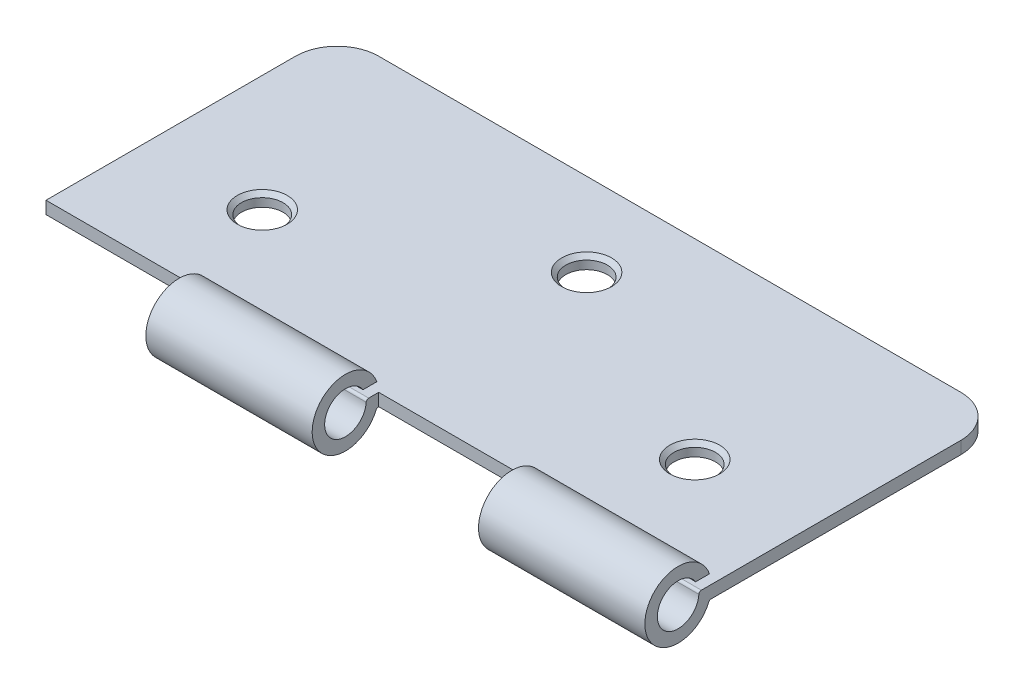
ISO-10303-21;
HEADER;
FILE_DESCRIPTION(('STEP AP214'),'2;1');
FILE_NAME('part.step','',(''),(''),'','','');
FILE_SCHEMA(('AUTOMOTIVE_DESIGN { 1 0 10303 214 1 1 1 1 }'));
ENDSEC;
DATA;
#1=APPLICATION_CONTEXT('core data for automotive mechanical design processes');
#2=APPLICATION_PROTOCOL_DEFINITION('international standard','automotive_design',2000,#1);
#3=PRODUCT_CONTEXT('',#1,'mechanical');
#4=PRODUCT('Part','Part','',(#3));
#5=PRODUCT_RELATED_PRODUCT_CATEGORY('part','',(#4));
#6=PRODUCT_DEFINITION_FORMATION('','',#4);
#7=PRODUCT_DEFINITION_CONTEXT('part definition',#1,'design');
#8=PRODUCT_DEFINITION('design','',#6,#7);
#9=PRODUCT_DEFINITION_SHAPE('','',#8);
#10=(LENGTH_UNIT() NAMED_UNIT(*) SI_UNIT(.MILLI.,.METRE.));
#11=(NAMED_UNIT(*) PLANE_ANGLE_UNIT() SI_UNIT($,.RADIAN.));
#12=(NAMED_UNIT(*) SI_UNIT($,.STERADIAN.) SOLID_ANGLE_UNIT());
#13=UNCERTAINTY_MEASURE_WITH_UNIT(LENGTH_MEASURE(1.E-05),#10,'distance_accuracy_value','');
#14=(GEOMETRIC_REPRESENTATION_CONTEXT(3) GLOBAL_UNCERTAINTY_ASSIGNED_CONTEXT((#13)) GLOBAL_UNIT_ASSIGNED_CONTEXT((#10,
#11,#12)) REPRESENTATION_CONTEXT('',''));
#15=CARTESIAN_POINT('',(0.,0.,0.));
#16=DIRECTION('',(0.,0.,1.));
#17=DIRECTION('',(1.,0.,0.));
#18=AXIS2_PLACEMENT_3D('',#15,#16,#17);
#19=CARTESIAN_POINT('',(40.,1.5,17.5));
#20=DIRECTION('',(0.,0.,-1.));
#21=DIRECTION('',(-1.,0.,0.));
#22=AXIS2_PLACEMENT_3D('',#19,#20,#21);
#23=PLANE('',#22);
#24=DIRECTION('',(0.,1.,0.));
#25=VECTOR('',#24,1.);
#26=CARTESIAN_POINT('',(-20.,0.,17.5));
#27=LINE('',#26,#25);
#28=CARTESIAN_POINT('',(-20.,0.,17.5));
#29=VERTEX_POINT('',#28);
#30=CARTESIAN_POINT('',(-20.,1.5,17.5));
#31=VERTEX_POINT('',#30);
#32=EDGE_CURVE('E56',#29,#31,#27,.T.);
#33=ORIENTED_EDGE('',*,*,#32,.T.);
#34=DIRECTION('',(1.,0.,0.));
#35=VECTOR('',#34,1.);
#36=CARTESIAN_POINT('',(40.,1.5,17.5));
#37=LINE('',#36,#35);
#38=CARTESIAN_POINT('',(-40.,1.5,17.5));
#39=VERTEX_POINT('',#38);
#40=EDGE_CURVE('E199',#39,#31,#37,.T.);
#41=ORIENTED_EDGE('',*,*,#40,.F.);
#42=DIRECTION('',(0.,-1.,0.));
#43=VECTOR('',#42,1.);
#44=CARTESIAN_POINT('',(-40.,1.5,17.5));
#45=LINE('',#44,#43);
#46=CARTESIAN_POINT('',(-40.,0.,17.5));
#47=VERTEX_POINT('',#46);
#48=EDGE_CURVE('E286',#39,#47,#45,.T.);
#49=ORIENTED_EDGE('',*,*,#48,.T.);
#50=DIRECTION('',(1.,0.,0.));
#51=VECTOR('',#50,1.);
#52=CARTESIAN_POINT('',(40.,0.,17.5));
#53=LINE('',#52,#51);
#54=EDGE_CURVE('E279',#47,#29,#53,.T.);
#55=ORIENTED_EDGE('',*,*,#54,.T.);
#56=EDGE_LOOP('',(#33,#41,#49,#55));
#57=FACE_BOUND('',#56,.T.);
#58=ADVANCED_FACE('F33',(#57),#23,.F.);
#59=CARTESIAN_POINT('',(40.,1.5,17.5));
#60=DIRECTION('',(-1.,0.,0.));
#61=DIRECTION('',(0.,0.,1.));
#62=AXIS2_PLACEMENT_3D('',#59,#60,#61);
#63=PLANE('',#62);
#64=DIRECTION('',(0.,0.,-1.));
#65=VECTOR('',#64,1.);
#66=CARTESIAN_POINT('',(40.,0.,17.5));
#67=LINE('',#66,#65);
#68=CARTESIAN_POINT('',(40.,0.,17.5));
#69=VERTEX_POINT('',#68);
#70=CARTESIAN_POINT('',(40.,0.,-12.5));
#71=VERTEX_POINT('',#70);
#72=EDGE_CURVE('E266',#69,#71,#67,.T.);
#73=ORIENTED_EDGE('',*,*,#72,.T.);
#74=DIRECTION('',(0.,-1.,0.));
#75=VECTOR('',#74,1.);
#76=CARTESIAN_POINT('',(40.,1.5,-12.5));
#77=LINE('',#76,#75);
#78=CARTESIAN_POINT('',(40.,1.5,-12.5));
#79=VERTEX_POINT('',#78);
#80=EDGE_CURVE('E291',#79,#71,#77,.T.);
#81=ORIENTED_EDGE('',*,*,#80,.F.);
#82=DIRECTION('',(0.,0.,-1.));
#83=VECTOR('',#82,1.);
#84=CARTESIAN_POINT('',(40.,1.5,17.5));
#85=LINE('',#84,#83);
#86=CARTESIAN_POINT('',(40.,1.5,18.7035374517229));
#87=VERTEX_POINT('',#86);
#88=EDGE_CURVE('E290',#87,#79,#85,.T.);
#89=ORIENTED_EDGE('',*,*,#88,.F.);
#90=CARTESIAN_POINT('',(40.,1.2,18.7035374517229));
#91=DIRECTION('',(1.,0.,0.));
#92=DIRECTION('',(0.,0.,-1.));
#93=AXIS2_PLACEMENT_3D('',#90,#91,#92);
#94=CIRCLE('',#93,0.299999999999999);
#95=CARTESIAN_POINT('',(40.,1.21876934414288,19.0029497288934));
#96=VERTEX_POINT('',#95);
#97=EDGE_CURVE('E237',#87,#96,#94,.T.);
#98=ORIENTED_EDGE('',*,*,#97,.T.);
#99=CARTESIAN_POINT('',(40.,1.37518054533356,21.4980520386479));
#100=DIRECTION('',(1.,0.,0.));
#101=DIRECTION('',(0.,0.,-1.));
#102=AXIS2_PLACEMENT_3D('',#99,#100,#101);
#103=CIRCLE('',#102,2.5);
#104=CARTESIAN_POINT('',(40.,2.71268890348687,19.3859271863085));
#105=VERTEX_POINT('',#104);
#106=EDGE_CURVE('E526',#105,#96,#103,.T.);
#107=ORIENTED_EDGE('',*,*,#106,.F.);
#108=DIRECTION('',(0.,0.,-1.));
#109=VECTOR('',#108,1.);
#110=CARTESIAN_POINT('',(40.,2.71268890348687,19.3859271863085));
#111=LINE('',#110,#109);
#112=CARTESIAN_POINT('',(40.,2.71268890348687,17.7282945674212));
#113=VERTEX_POINT('',#112);
#114=EDGE_CURVE('E529',#105,#113,#111,.T.);
#115=ORIENTED_EDGE('',*,*,#114,.T.);
#116=CARTESIAN_POINT('',(40.,1.37518054533356,21.4980520386479));
#117=DIRECTION('',(1.,0.,0.));
#118=DIRECTION('',(0.,0.,-1.));
#119=AXIS2_PLACEMENT_3D('',#116,#117,#118);
#120=CIRCLE('',#119,4.);
#121=CARTESIAN_POINT('',(40.,-0.182486040506084,17.8138051946703));
#122=VERTEX_POINT('',#121);
#123=EDGE_CURVE('E375',#113,#122,#120,.T.);
#124=ORIENTED_EDGE('',*,*,#123,.T.);
#125=CARTESIAN_POINT('',(40.,-0.299311034444057,17.537486681372));
#126=DIRECTION('',(1.,0.,0.));
#127=DIRECTION('',(0.,0.,-1.));
#128=AXIS2_PLACEMENT_3D('',#125,#126,#127);
#129=CIRCLE('',#128,0.299999999999998);
#130=CARTESIAN_POINT('',(40.,0.000629130852483725,17.5314952506678));
#131=VERTEX_POINT('',#130);
#132=EDGE_CURVE('E373',#131,#122,#129,.T.);
#133=ORIENTED_EDGE('',*,*,#132,.F.);
#134=DIRECTION('',(0.,0.019971435680647,0.999800550988473));
#135=VECTOR('',#134,1.);
#136=CARTESIAN_POINT('',(40.,0.,17.5));
#137=LINE('',#136,#135);
#138=EDGE_CURVE('E257',#69,#131,#137,.T.);
#139=ORIENTED_EDGE('',*,*,#138,.F.);
#140=EDGE_LOOP('',(#73,#81,#89,#98,#107,#115,#124,#133,#139));
#141=FACE_BOUND('',#140,.T.);
#142=ADVANCED_FACE('F369',(#141),#63,.F.);
#143=CARTESIAN_POINT('',(35.,1.5,-12.5));
#144=DIRECTION('',(0.,-1.,0.));
#145=DIRECTION('',(0.,0.,-1.));
#146=AXIS2_PLACEMENT_3D('',#143,#144,#145);
#147=CYLINDRICAL_SURFACE('',#146,5.);
#148=CARTESIAN_POINT('',(35.,0.,-12.5));
#149=DIRECTION('',(0.,1.,0.));
#150=DIRECTION('',(0.,0.,1.));
#151=AXIS2_PLACEMENT_3D('',#148,#149,#150);
#152=CIRCLE('',#151,5.);
#153=CARTESIAN_POINT('',(35.,0.,-17.5));
#154=VERTEX_POINT('',#153);
#155=EDGE_CURVE('E321',#71,#154,#152,.T.);
#156=ORIENTED_EDGE('',*,*,#155,.T.);
#157=DIRECTION('',(0.,-1.,0.));
#158=VECTOR('',#157,1.);
#159=CARTESIAN_POINT('',(35.,1.5,-17.5));
#160=LINE('',#159,#158);
#161=CARTESIAN_POINT('',(35.,1.5,-17.5));
#162=VERTEX_POINT('',#161);
#163=EDGE_CURVE('E295',#162,#154,#160,.T.);
#164=ORIENTED_EDGE('',*,*,#163,.F.);
#165=CARTESIAN_POINT('',(35.,1.5,-12.5));
#166=DIRECTION('',(0.,1.,0.));
#167=DIRECTION('',(0.,0.,1.));
#168=AXIS2_PLACEMENT_3D('',#165,#166,#167);
#169=CIRCLE('',#168,5.);
#170=EDGE_CURVE('E391',#79,#162,#169,.T.);
#171=ORIENTED_EDGE('',*,*,#170,.F.);
#172=ORIENTED_EDGE('',*,*,#80,.T.);
#173=EDGE_LOOP('',(#156,#164,#171,#172));
#174=FACE_BOUND('',#173,.T.);
#175=ADVANCED_FACE('F406',(#174),#147,.T.);
#176=CARTESIAN_POINT('',(35.,1.5,-17.5));
#177=DIRECTION('',(0.,0.,1.));
#178=DIRECTION('',(1.,0.,0.));
#179=AXIS2_PLACEMENT_3D('',#176,#177,#178);
#180=PLANE('',#179);
#181=DIRECTION('',(-1.,0.,0.));
#182=VECTOR('',#181,1.);
#183=CARTESIAN_POINT('',(35.,0.,-17.5));
#184=LINE('',#183,#182);
#185=CARTESIAN_POINT('',(-35.,0.,-17.5));
#186=VERTEX_POINT('',#185);
#187=EDGE_CURVE('E323',#154,#186,#184,.T.);
#188=ORIENTED_EDGE('',*,*,#187,.T.);
#189=DIRECTION('',(0.,-1.,0.));
#190=VECTOR('',#189,1.);
#191=CARTESIAN_POINT('',(-35.,1.5,-17.5));
#192=LINE('',#191,#190);
#193=CARTESIAN_POINT('',(-35.,1.5,-17.5));
#194=VERTEX_POINT('',#193);
#195=EDGE_CURVE('E298',#194,#186,#192,.T.);
#196=ORIENTED_EDGE('',*,*,#195,.F.);
#197=DIRECTION('',(-1.,0.,0.));
#198=VECTOR('',#197,1.);
#199=CARTESIAN_POINT('',(35.,1.5,-17.5));
#200=LINE('',#199,#198);
#201=EDGE_CURVE('E313',#162,#194,#200,.T.);
#202=ORIENTED_EDGE('',*,*,#201,.F.);
#203=ORIENTED_EDGE('',*,*,#163,.T.);
#204=EDGE_LOOP('',(#188,#196,#202,#203));
#205=FACE_BOUND('',#204,.T.);
#206=ADVANCED_FACE('F397',(#205),#180,.F.);
#207=CARTESIAN_POINT('',(-35.,1.5,-12.5));
#208=DIRECTION('',(0.,-1.,0.));
#209=DIRECTION('',(0.,0.,-1.));
#210=AXIS2_PLACEMENT_3D('',#207,#208,#209);
#211=CYLINDRICAL_SURFACE('',#210,5.);
#212=CARTESIAN_POINT('',(-35.,0.,-12.5));
#213=DIRECTION('',(0.,1.,0.));
#214=DIRECTION('',(0.,0.,1.));
#215=AXIS2_PLACEMENT_3D('',#212,#213,#214);
#216=CIRCLE('',#215,5.);
#217=CARTESIAN_POINT('',(-40.,0.,-12.5));
#218=VERTEX_POINT('',#217);
#219=EDGE_CURVE('E324',#186,#218,#216,.T.);
#220=ORIENTED_EDGE('',*,*,#219,.T.);
#221=DIRECTION('',(0.,-1.,0.));
#222=VECTOR('',#221,1.);
#223=CARTESIAN_POINT('',(-40.,1.5,-12.5));
#224=LINE('',#223,#222);
#225=CARTESIAN_POINT('',(-40.,1.5,-12.5));
#226=VERTEX_POINT('',#225);
#227=EDGE_CURVE('E300',#226,#218,#224,.T.);
#228=ORIENTED_EDGE('',*,*,#227,.F.);
#229=CARTESIAN_POINT('',(-35.,1.5,-12.5));
#230=DIRECTION('',(0.,1.,0.));
#231=DIRECTION('',(0.,0.,1.));
#232=AXIS2_PLACEMENT_3D('',#229,#230,#231);
#233=CIRCLE('',#232,5.);
#234=EDGE_CURVE('E311',#194,#226,#233,.T.);
#235=ORIENTED_EDGE('',*,*,#234,.F.);
#236=ORIENTED_EDGE('',*,*,#195,.T.);
#237=EDGE_LOOP('',(#220,#228,#235,#236));
#238=FACE_BOUND('',#237,.T.);
#239=ADVANCED_FACE('F398',(#238),#211,.T.);
#240=CARTESIAN_POINT('',(-40.,1.5,17.5));
#241=DIRECTION('',(1.,0.,0.));
#242=DIRECTION('',(0.,0.,-1.));
#243=AXIS2_PLACEMENT_3D('',#240,#241,#242);
#244=PLANE('',#243);
#245=DIRECTION('',(0.,0.,1.));
#246=VECTOR('',#245,1.);
#247=CARTESIAN_POINT('',(-40.,0.,17.5));
#248=LINE('',#247,#246);
#249=EDGE_CURVE('E280',#218,#47,#248,.T.);
#250=ORIENTED_EDGE('',*,*,#249,.T.);
#251=ORIENTED_EDGE('',*,*,#48,.F.);
#252=DIRECTION('',(0.,0.,1.));
#253=VECTOR('',#252,1.);
#254=CARTESIAN_POINT('',(-40.,1.5,17.5));
#255=LINE('',#254,#253);
#256=EDGE_CURVE('E309',#226,#39,#255,.T.);
#257=ORIENTED_EDGE('',*,*,#256,.F.);
#258=ORIENTED_EDGE('',*,*,#227,.T.);
#259=EDGE_LOOP('',(#250,#251,#257,#258));
#260=FACE_BOUND('',#259,.T.);
#261=ADVANCED_FACE('F327',(#260),#244,.F.);
#262=CARTESIAN_POINT('',(0.,1.5,17.5));
#263=VERTEX_POINT('',#262);
#264=CARTESIAN_POINT('',(20.,1.5,17.5));
#265=VERTEX_POINT('',#264);
#266=EDGE_CURVE('E48',#263,#265,#37,.T.);
#267=ORIENTED_EDGE('',*,*,#266,.F.);
#268=DIRECTION('',(0.,1.,0.));
#269=VECTOR('',#268,1.);
#270=CARTESIAN_POINT('',(0.,0.,17.5));
#271=LINE('',#270,#269);
#272=CARTESIAN_POINT('',(0.,0.,17.5));
#273=VERTEX_POINT('',#272);
#274=EDGE_CURVE('E214',#273,#263,#271,.T.);
#275=ORIENTED_EDGE('',*,*,#274,.F.);
#276=CARTESIAN_POINT('',(20.,0.,17.5));
#277=VERTEX_POINT('',#276);
#278=EDGE_CURVE('E276',#273,#277,#53,.T.);
#279=ORIENTED_EDGE('',*,*,#278,.T.);
#280=DIRECTION('',(0.,1.,0.));
#281=VECTOR('',#280,1.);
#282=CARTESIAN_POINT('',(20.,0.,17.5));
#283=LINE('',#282,#281);
#284=EDGE_CURVE('E253',#277,#265,#283,.T.);
#285=ORIENTED_EDGE('',*,*,#284,.T.);
#286=EDGE_LOOP('',(#267,#275,#279,#285));
#287=FACE_BOUND('',#286,.T.);
#288=ADVANCED_FACE('F354',(#287),#23,.F.);
#289=CARTESIAN_POINT('',(35.,1.5,-12.5));
#290=DIRECTION('',(0.,1.,0.));
#291=DIRECTION('',(0.,0.,1.));
#292=AXIS2_PLACEMENT_3D('',#289,#290,#291);
#293=PLANE('',#292);
#294=CARTESIAN_POINT('',(26.,1.5,5.50000000000001));
#295=DIRECTION('',(0.,1.,0.));
#296=DIRECTION('',(0.,0.,1.));
#297=AXIS2_PLACEMENT_3D('',#294,#295,#296);
#298=CIRCLE('',#297,3.);
#299=CARTESIAN_POINT('',(26.,1.5,8.50000000000001));
#300=VERTEX_POINT('',#299);
#301=EDGE_CURVE('E504',#300,#300,#298,.F.);
#302=ORIENTED_EDGE('',*,*,#301,.T.);
#303=EDGE_LOOP('',(#302));
#304=FACE_BOUND('',#303,.T.);
#305=CARTESIAN_POINT('',(0.,1.5,-7.5));
#306=DIRECTION('',(0.,1.,0.));
#307=DIRECTION('',(0.,0.,1.));
#308=AXIS2_PLACEMENT_3D('',#305,#306,#307);
#309=CIRCLE('',#308,2.99999999999999);
#310=CARTESIAN_POINT('',(0.,1.5,-4.50000000000001));
#311=VERTEX_POINT('',#310);
#312=EDGE_CURVE('E501',#311,#311,#309,.F.);
#313=ORIENTED_EDGE('',*,*,#312,.T.);
#314=EDGE_LOOP('',(#313));
#315=FACE_BOUND('',#314,.T.);
#316=CARTESIAN_POINT('',(-26.,1.5,5.50000000000001));
#317=DIRECTION('',(0.,1.,0.));
#318=DIRECTION('',(0.,0.,1.));
#319=AXIS2_PLACEMENT_3D('',#316,#317,#318);
#320=CIRCLE('',#319,3.);
#321=CARTESIAN_POINT('',(-26.,1.5,8.50000000000001));
#322=VERTEX_POINT('',#321);
#323=EDGE_CURVE('E498',#322,#322,#320,.F.);
#324=ORIENTED_EDGE('',*,*,#323,.T.);
#325=EDGE_LOOP('',(#324));
#326=FACE_BOUND('',#325,.T.);
#327=ORIENTED_EDGE('',*,*,#88,.T.);
#328=ORIENTED_EDGE('',*,*,#170,.T.);
#329=ORIENTED_EDGE('',*,*,#201,.T.);
#330=ORIENTED_EDGE('',*,*,#234,.T.);
#331=ORIENTED_EDGE('',*,*,#256,.T.);
#332=ORIENTED_EDGE('',*,*,#40,.T.);
#333=DIRECTION('',(0.,0.,1.));
#334=VECTOR('',#333,1.);
#335=CARTESIAN_POINT('',(-20.,1.5,17.5));
#336=LINE('',#335,#334);
#337=CARTESIAN_POINT('',(-20.,1.5,18.7035374517229));
#338=VERTEX_POINT('',#337);
#339=EDGE_CURVE('E191',#31,#338,#336,.T.);
#340=ORIENTED_EDGE('',*,*,#339,.T.);
#341=DIRECTION('',(1.,0.,0.));
#342=VECTOR('',#341,1.);
#343=CARTESIAN_POINT('',(-20.,1.5,18.7035374517229));
#344=LINE('',#343,#342);
#345=CARTESIAN_POINT('',(0.,1.5,18.7035374517229));
#346=VERTEX_POINT('',#345);
#347=EDGE_CURVE('E176',#338,#346,#344,.T.);
#348=ORIENTED_EDGE('',*,*,#347,.T.);
#349=DIRECTION('',(0.,0.,1.));
#350=VECTOR('',#349,1.);
#351=CARTESIAN_POINT('',(0.,1.5,17.5));
#352=LINE('',#351,#350);
#353=EDGE_CURVE('E217',#263,#346,#352,.T.);
#354=ORIENTED_EDGE('',*,*,#353,.F.);
#355=ORIENTED_EDGE('',*,*,#266,.T.);
#356=DIRECTION('',(0.,0.,1.));
#357=VECTOR('',#356,1.);
#358=CARTESIAN_POINT('',(20.,1.5,17.5));
#359=LINE('',#358,#357);
#360=CARTESIAN_POINT('',(20.,1.5,18.7035374517229));
#361=VERTEX_POINT('',#360);
#362=EDGE_CURVE('E256',#265,#361,#359,.T.);
#363=ORIENTED_EDGE('',*,*,#362,.T.);
#364=DIRECTION('',(1.,0.,0.));
#365=VECTOR('',#364,1.);
#366=CARTESIAN_POINT('',(20.,1.5,18.7035374517229));
#367=LINE('',#366,#365);
#368=EDGE_CURVE('E272',#361,#87,#367,.T.);
#369=ORIENTED_EDGE('',*,*,#368,.T.);
#370=EDGE_LOOP('',(#327,#328,#329,#330,#331,#332,#340,#348,#354,#355,#363,#369));
#371=FACE_BOUND('',#370,.T.);
#372=ADVANCED_FACE('F198',(#304,#315,#326,#371),#293,.T.);
#373=CARTESIAN_POINT('',(35.,0.,-12.5));
#374=DIRECTION('',(0.,1.,0.));
#375=DIRECTION('',(0.,0.,1.));
#376=AXIS2_PLACEMENT_3D('',#373,#374,#375);
#377=PLANE('',#376);
#378=CARTESIAN_POINT('',(26.,0.,5.50000000000001));
#379=DIRECTION('',(0.,1.,0.));
#380=DIRECTION('',(0.,0.,1.));
#381=AXIS2_PLACEMENT_3D('',#378,#379,#380);
#382=CIRCLE('',#381,2.5);
#383=CARTESIAN_POINT('',(26.,0.,8.00000000000001));
#384=VERTEX_POINT('',#383);
#385=EDGE_CURVE('E491',#384,#384,#382,.T.);
#386=ORIENTED_EDGE('',*,*,#385,.T.);
#387=EDGE_LOOP('',(#386));
#388=FACE_BOUND('',#387,.T.);
#389=CARTESIAN_POINT('',(-26.,0.,5.50000000000001));
#390=DIRECTION('',(0.,1.,0.));
#391=DIRECTION('',(0.,0.,1.));
#392=AXIS2_PLACEMENT_3D('',#389,#390,#391);
#393=CIRCLE('',#392,2.5);
#394=CARTESIAN_POINT('',(-26.,0.,8.00000000000001));
#395=VERTEX_POINT('',#394);
#396=EDGE_CURVE('E492',#395,#395,#393,.T.);
#397=ORIENTED_EDGE('',*,*,#396,.T.);
#398=EDGE_LOOP('',(#397));
#399=FACE_BOUND('',#398,.T.);
#400=CARTESIAN_POINT('',(0.,0.,-7.5));
#401=DIRECTION('',(0.,1.,0.));
#402=DIRECTION('',(0.,0.,1.));
#403=AXIS2_PLACEMENT_3D('',#400,#401,#402);
#404=CIRCLE('',#403,2.5);
#405=CARTESIAN_POINT('',(0.,0.,-5.));
#406=VERTEX_POINT('',#405);
#407=EDGE_CURVE('E218',#406,#406,#404,.T.);
#408=ORIENTED_EDGE('',*,*,#407,.T.);
#409=EDGE_LOOP('',(#408));
#410=FACE_BOUND('',#409,.T.);
#411=ORIENTED_EDGE('',*,*,#72,.F.);
#412=DIRECTION('',(1.,0.,0.));
#413=VECTOR('',#412,1.);
#414=CARTESIAN_POINT('',(20.,0.,17.5));
#415=LINE('',#414,#413);
#416=EDGE_CURVE('E264',#277,#69,#415,.T.);
#417=ORIENTED_EDGE('',*,*,#416,.F.);
#418=ORIENTED_EDGE('',*,*,#278,.F.);
#419=DIRECTION('',(1.,0.,0.));
#420=VECTOR('',#419,1.);
#421=CARTESIAN_POINT('',(-20.,0.,17.5));
#422=LINE('',#421,#420);
#423=EDGE_CURVE('E234',#29,#273,#422,.T.);
#424=ORIENTED_EDGE('',*,*,#423,.F.);
#425=ORIENTED_EDGE('',*,*,#54,.F.);
#426=ORIENTED_EDGE('',*,*,#249,.F.);
#427=ORIENTED_EDGE('',*,*,#219,.F.);
#428=ORIENTED_EDGE('',*,*,#187,.F.);
#429=ORIENTED_EDGE('',*,*,#155,.F.);
#430=EDGE_LOOP('',(#411,#417,#418,#424,#425,#426,#427,#428,#429));
#431=FACE_BOUND('',#430,.T.);
#432=ADVANCED_FACE('F330',(#388,#399,#410,#431),#377,.F.);
#433=CARTESIAN_POINT('',(20.,0.,17.5));
#434=DIRECTION('',(0.,0.999800550988473,-0.019971435680647));
#435=DIRECTION('',(0.,0.019971435680647,0.999800550988473));
#436=AXIS2_PLACEMENT_3D('',#433,#434,#435);
#437=PLANE('',#436);
#438=ORIENTED_EDGE('',*,*,#138,.T.);
#439=DIRECTION('',(1.,0.,0.));
#440=VECTOR('',#439,1.);
#441=CARTESIAN_POINT('',(20.,0.000629130852483725,17.5314952506678));
#442=LINE('',#441,#440);
#443=CARTESIAN_POINT('',(20.,0.000629130852483725,17.5314952506678));
#444=VERTEX_POINT('',#443);
#445=EDGE_CURVE('E267',#444,#131,#442,.T.);
#446=ORIENTED_EDGE('',*,*,#445,.F.);
#447=DIRECTION('',(0.,0.019971435680647,0.999800550988473));
#448=VECTOR('',#447,1.);
#449=CARTESIAN_POINT('',(20.,0.,17.5));
#450=LINE('',#449,#448);
#451=EDGE_CURVE('E270',#277,#444,#450,.T.);
#452=ORIENTED_EDGE('',*,*,#451,.F.);
#453=ORIENTED_EDGE('',*,*,#416,.T.);
#454=EDGE_LOOP('',(#438,#446,#452,#453));
#455=FACE_BOUND('',#454,.T.);
#456=ADVANCED_FACE('F360',(#455),#437,.F.);
#457=CARTESIAN_POINT('',(20.,-0.299311034444057,17.537486681372));
#458=DIRECTION('',(1.,0.,0.));
#459=DIRECTION('',(0.,0.,-1.));
#460=AXIS2_PLACEMENT_3D('',#457,#458,#459);
#461=CYLINDRICAL_SURFACE('',#460,0.299999999999998);
#462=ORIENTED_EDGE('',*,*,#132,.T.);
#463=DIRECTION('',(1.,0.,0.));
#464=VECTOR('',#463,1.);
#465=CARTESIAN_POINT('',(20.,-0.182486040506084,17.8138051946703));
#466=LINE('',#465,#464);
#467=CARTESIAN_POINT('',(20.,-0.182486040506084,17.8138051946703));
#468=VERTEX_POINT('',#467);
#469=EDGE_CURVE('E380',#468,#122,#466,.T.);
#470=ORIENTED_EDGE('',*,*,#469,.F.);
#471=CARTESIAN_POINT('',(20.,-0.299311034444057,17.537486681372));
#472=DIRECTION('',(1.,0.,0.));
#473=DIRECTION('',(0.,0.,-1.));
#474=AXIS2_PLACEMENT_3D('',#471,#472,#473);
#475=CIRCLE('',#474,0.299999999999998);
#476=EDGE_CURVE('E273',#444,#468,#475,.T.);
#477=ORIENTED_EDGE('',*,*,#476,.F.);
#478=ORIENTED_EDGE('',*,*,#445,.T.);
#479=EDGE_LOOP('',(#462,#470,#477,#478));
#480=FACE_BOUND('',#479,.T.);
#481=ADVANCED_FACE('F443',(#480),#461,.F.);
#482=CARTESIAN_POINT('',(20.,1.37518054533356,21.4980520386479));
#483=DIRECTION('',(1.,0.,0.));
#484=DIRECTION('',(0.,0.,-1.));
#485=AXIS2_PLACEMENT_3D('',#482,#483,#484);
#486=CYLINDRICAL_SURFACE('',#485,4.);
#487=ORIENTED_EDGE('',*,*,#123,.F.);
#488=DIRECTION('',(1.,0.,0.));
#489=VECTOR('',#488,1.);
#490=CARTESIAN_POINT('',(20.,2.71268890348687,17.7282945674212));
#491=LINE('',#490,#489);
#492=CARTESIAN_POINT('',(20.,2.71268890348687,17.7282945674212));
#493=VERTEX_POINT('',#492);
#494=EDGE_CURVE('E382',#493,#113,#491,.T.);
#495=ORIENTED_EDGE('',*,*,#494,.F.);
#496=CARTESIAN_POINT('',(20.,1.37518054533356,21.4980520386479));
#497=DIRECTION('',(1.,0.,0.));
#498=DIRECTION('',(0.,0.,-1.));
#499=AXIS2_PLACEMENT_3D('',#496,#497,#498);
#500=CIRCLE('',#499,4.);
#501=EDGE_CURVE('E538',#493,#468,#500,.T.);
#502=ORIENTED_EDGE('',*,*,#501,.T.);
#503=ORIENTED_EDGE('',*,*,#469,.T.);
#504=EDGE_LOOP('',(#487,#495,#502,#503));
#505=FACE_BOUND('',#504,.T.);
#506=ADVANCED_FACE('F439',(#505),#486,.T.);
#507=CARTESIAN_POINT('',(20.,2.71268890348687,19.3859271863085));
#508=DIRECTION('',(0.,-1.,0.));
#509=DIRECTION('',(0.,0.,-1.));
#510=AXIS2_PLACEMENT_3D('',#507,#508,#509);
#511=PLANE('',#510);
#512=ORIENTED_EDGE('',*,*,#114,.F.);
#513=DIRECTION('',(1.,0.,0.));
#514=VECTOR('',#513,1.);
#515=CARTESIAN_POINT('',(20.,2.71268890348687,19.3859271863085));
#516=LINE('',#515,#514);
#517=CARTESIAN_POINT('',(20.,2.71268890348687,19.3859271863085));
#518=VERTEX_POINT('',#517);
#519=EDGE_CURVE('E384',#518,#105,#516,.T.);
#520=ORIENTED_EDGE('',*,*,#519,.F.);
#521=DIRECTION('',(0.,0.,-1.));
#522=VECTOR('',#521,1.);
#523=CARTESIAN_POINT('',(20.,2.71268890348687,19.3859271863085));
#524=LINE('',#523,#522);
#525=EDGE_CURVE('E539',#518,#493,#524,.T.);
#526=ORIENTED_EDGE('',*,*,#525,.T.);
#527=ORIENTED_EDGE('',*,*,#494,.T.);
#528=EDGE_LOOP('',(#512,#520,#526,#527));
#529=FACE_BOUND('',#528,.T.);
#530=ADVANCED_FACE('F435',(#529),#511,.T.);
#531=CARTESIAN_POINT('',(20.,1.37518054533356,21.4980520386479));
#532=DIRECTION('',(1.,0.,0.));
#533=DIRECTION('',(0.,0.,-1.));
#534=AXIS2_PLACEMENT_3D('',#531,#532,#533);
#535=CYLINDRICAL_SURFACE('',#534,2.5);
#536=ORIENTED_EDGE('',*,*,#106,.T.);
#537=DIRECTION('',(1.,0.,0.));
#538=VECTOR('',#537,1.);
#539=CARTESIAN_POINT('',(20.,1.21876934414288,19.0029497288934));
#540=LINE('',#539,#538);
#541=CARTESIAN_POINT('',(20.,1.21876934414288,19.0029497288934));
#542=VERTEX_POINT('',#541);
#543=EDGE_CURVE('E386',#542,#96,#540,.T.);
#544=ORIENTED_EDGE('',*,*,#543,.F.);
#545=CARTESIAN_POINT('',(20.,1.37518054533356,21.4980520386479));
#546=DIRECTION('',(1.,0.,0.));
#547=DIRECTION('',(0.,0.,-1.));
#548=AXIS2_PLACEMENT_3D('',#545,#546,#547);
#549=CIRCLE('',#548,2.5);
#550=EDGE_CURVE('E541',#518,#542,#549,.T.);
#551=ORIENTED_EDGE('',*,*,#550,.F.);
#552=ORIENTED_EDGE('',*,*,#519,.T.);
#553=EDGE_LOOP('',(#536,#544,#551,#552));
#554=FACE_BOUND('',#553,.T.);
#555=ADVANCED_FACE('F431',(#554),#535,.F.);
#556=CARTESIAN_POINT('',(20.,1.2,18.7035374517229));
#557=DIRECTION('',(1.,0.,0.));
#558=DIRECTION('',(0.,0.,-1.));
#559=AXIS2_PLACEMENT_3D('',#556,#557,#558);
#560=CYLINDRICAL_SURFACE('',#559,0.299999999999999);
#561=ORIENTED_EDGE('',*,*,#97,.F.);
#562=ORIENTED_EDGE('',*,*,#368,.F.);
#563=CARTESIAN_POINT('',(20.,1.2,18.7035374517229));
#564=DIRECTION('',(1.,0.,0.));
#565=DIRECTION('',(0.,0.,-1.));
#566=AXIS2_PLACEMENT_3D('',#563,#564,#565);
#567=CIRCLE('',#566,0.299999999999999);
#568=EDGE_CURVE('E250',#361,#542,#567,.T.);
#569=ORIENTED_EDGE('',*,*,#568,.T.);
#570=ORIENTED_EDGE('',*,*,#543,.T.);
#571=EDGE_LOOP('',(#561,#562,#569,#570));
#572=FACE_BOUND('',#571,.T.);
#573=ADVANCED_FACE('F428',(#572),#560,.T.);
#574=CARTESIAN_POINT('',(20.,1.2,18.7035374517229));
#575=DIRECTION('',(1.,0.,0.));
#576=DIRECTION('',(0.,0.,-1.));
#577=AXIS2_PLACEMENT_3D('',#574,#575,#576);
#578=PLANE('',#577);
#579=ORIENTED_EDGE('',*,*,#284,.F.);
#580=ORIENTED_EDGE('',*,*,#451,.T.);
#581=ORIENTED_EDGE('',*,*,#476,.T.);
#582=ORIENTED_EDGE('',*,*,#501,.F.);
#583=ORIENTED_EDGE('',*,*,#525,.F.);
#584=ORIENTED_EDGE('',*,*,#550,.T.);
#585=ORIENTED_EDGE('',*,*,#568,.F.);
#586=ORIENTED_EDGE('',*,*,#362,.F.);
#587=EDGE_LOOP('',(#579,#580,#581,#582,#583,#584,#585,#586));
#588=FACE_BOUND('',#587,.T.);
#589=ADVANCED_FACE('F365',(#588),#578,.F.);
#590=CARTESIAN_POINT('',(-20.,0.,17.5));
#591=DIRECTION('',(0.,0.999800550988473,-0.019971435680647));
#592=DIRECTION('',(0.,0.019971435680647,0.999800550988473));
#593=AXIS2_PLACEMENT_3D('',#590,#591,#592);
#594=PLANE('',#593);
#595=DIRECTION('',(0.,0.019971435680647,0.999800550988473));
#596=VECTOR('',#595,1.);
#597=CARTESIAN_POINT('',(0.,0.,17.5));
#598=LINE('',#597,#596);
#599=CARTESIAN_POINT('',(0.,0.000629130852483725,17.5314952506678));
#600=VERTEX_POINT('',#599);
#601=EDGE_CURVE('E201',#273,#600,#598,.T.);
#602=ORIENTED_EDGE('',*,*,#601,.T.);
#603=DIRECTION('',(1.,0.,0.));
#604=VECTOR('',#603,1.);
#605=CARTESIAN_POINT('',(-20.,0.000629130852483725,17.5314952506678));
#606=LINE('',#605,#604);
#607=CARTESIAN_POINT('',(-20.,0.000629130852483725,17.5314952506678));
#608=VERTEX_POINT('',#607);
#609=EDGE_CURVE('E238',#608,#600,#606,.T.);
#610=ORIENTED_EDGE('',*,*,#609,.F.);
#611=DIRECTION('',(0.,0.019971435680647,0.999800550988473));
#612=VECTOR('',#611,1.);
#613=CARTESIAN_POINT('',(-20.,0.,17.5));
#614=LINE('',#613,#612);
#615=EDGE_CURVE('E186',#29,#608,#614,.T.);
#616=ORIENTED_EDGE('',*,*,#615,.F.);
#617=ORIENTED_EDGE('',*,*,#423,.T.);
#618=EDGE_LOOP('',(#602,#610,#616,#617));
#619=FACE_BOUND('',#618,.T.);
#620=ADVANCED_FACE('F335',(#619),#594,.F.);
#621=CARTESIAN_POINT('',(-20.,-0.299311034444057,17.537486681372));
#622=DIRECTION('',(1.,0.,0.));
#623=DIRECTION('',(0.,0.,-1.));
#624=AXIS2_PLACEMENT_3D('',#621,#622,#623);
#625=CYLINDRICAL_SURFACE('',#624,0.299999999999998);
#626=CARTESIAN_POINT('',(0.,-0.299311034444057,17.537486681372));
#627=DIRECTION('',(1.,0.,0.));
#628=DIRECTION('',(0.,0.,-1.));
#629=AXIS2_PLACEMENT_3D('',#626,#627,#628);
#630=CIRCLE('',#629,0.299999999999998);
#631=CARTESIAN_POINT('',(0.,-0.182486040506084,17.8138051946704));
#632=VERTEX_POINT('',#631);
#633=EDGE_CURVE('E230',#600,#632,#630,.T.);
#634=ORIENTED_EDGE('',*,*,#633,.T.);
#635=DIRECTION('',(1.,0.,0.));
#636=VECTOR('',#635,1.);
#637=CARTESIAN_POINT('',(-20.,-0.182486040506084,17.8138051946704));
#638=LINE('',#637,#636);
#639=CARTESIAN_POINT('',(-20.,-0.182486040506084,17.8138051946704));
#640=VERTEX_POINT('',#639);
#641=EDGE_CURVE('E241',#640,#632,#638,.T.);
#642=ORIENTED_EDGE('',*,*,#641,.F.);
#643=CARTESIAN_POINT('',(-20.,-0.299311034444057,17.537486681372));
#644=DIRECTION('',(1.,0.,0.));
#645=DIRECTION('',(0.,0.,-1.));
#646=AXIS2_PLACEMENT_3D('',#643,#644,#645);
#647=CIRCLE('',#646,0.299999999999998);
#648=EDGE_CURVE('E211',#608,#640,#647,.T.);
#649=ORIENTED_EDGE('',*,*,#648,.F.);
#650=ORIENTED_EDGE('',*,*,#609,.T.);
#651=EDGE_LOOP('',(#634,#642,#649,#650));
#652=FACE_BOUND('',#651,.T.);
#653=ADVANCED_FACE('F341',(#652),#625,.F.);
#654=CARTESIAN_POINT('',(-20.,1.37518054533356,21.4980520386479));
#655=DIRECTION('',(1.,0.,0.));
#656=DIRECTION('',(0.,0.,-1.));
#657=AXIS2_PLACEMENT_3D('',#654,#655,#656);
#658=CYLINDRICAL_SURFACE('',#657,4.);
#659=CARTESIAN_POINT('',(0.,1.37518054533356,21.4980520386479));
#660=DIRECTION('',(1.,0.,0.));
#661=DIRECTION('',(0.,0.,-1.));
#662=AXIS2_PLACEMENT_3D('',#659,#660,#661);
#663=CIRCLE('',#662,4.);
#664=CARTESIAN_POINT('',(0.,2.71268890348687,17.7282945674212));
#665=VERTEX_POINT('',#664);
#666=EDGE_CURVE('E227',#665,#632,#663,.T.);
#667=ORIENTED_EDGE('',*,*,#666,.F.);
#668=DIRECTION('',(1.,0.,0.));
#669=VECTOR('',#668,1.);
#670=CARTESIAN_POINT('',(-20.,2.71268890348687,17.7282945674212));
#671=LINE('',#670,#669);
#672=CARTESIAN_POINT('',(-20.,2.71268890348687,17.7282945674212));
#673=VERTEX_POINT('',#672);
#674=EDGE_CURVE('E243',#673,#665,#671,.T.);
#675=ORIENTED_EDGE('',*,*,#674,.F.);
#676=CARTESIAN_POINT('',(-20.,1.37518054533356,21.4980520386479));
#677=DIRECTION('',(1.,0.,0.));
#678=DIRECTION('',(0.,0.,-1.));
#679=AXIS2_PLACEMENT_3D('',#676,#677,#678);
#680=CIRCLE('',#679,4.);
#681=EDGE_CURVE('E208',#673,#640,#680,.T.);
#682=ORIENTED_EDGE('',*,*,#681,.T.);
#683=ORIENTED_EDGE('',*,*,#641,.T.);
#684=EDGE_LOOP('',(#667,#675,#682,#683));
#685=FACE_BOUND('',#684,.T.);
#686=ADVANCED_FACE('F345',(#685),#658,.T.);
#687=CARTESIAN_POINT('',(-20.,2.71268890348687,19.3859271863085));
#688=DIRECTION('',(0.,-1.,0.));
#689=DIRECTION('',(0.,0.,-1.));
#690=AXIS2_PLACEMENT_3D('',#687,#688,#689);
#691=PLANE('',#690);
#692=DIRECTION('',(0.,0.,-1.));
#693=VECTOR('',#692,1.);
#694=CARTESIAN_POINT('',(0.,2.71268890348687,19.3859271863085));
#695=LINE('',#694,#693);
#696=CARTESIAN_POINT('',(0.,2.71268890348687,19.3859271863085));
#697=VERTEX_POINT('',#696);
#698=EDGE_CURVE('E224',#697,#665,#695,.T.);
#699=ORIENTED_EDGE('',*,*,#698,.F.);
#700=DIRECTION('',(1.,0.,0.));
#701=VECTOR('',#700,1.);
#702=CARTESIAN_POINT('',(-20.,2.71268890348687,19.3859271863085));
#703=LINE('',#702,#701);
#704=CARTESIAN_POINT('',(-20.,2.71268890348687,19.3859271863085));
#705=VERTEX_POINT('',#704);
#706=EDGE_CURVE('E245',#705,#697,#703,.T.);
#707=ORIENTED_EDGE('',*,*,#706,.F.);
#708=DIRECTION('',(0.,0.,-1.));
#709=VECTOR('',#708,1.);
#710=CARTESIAN_POINT('',(-20.,2.71268890348687,19.3859271863085));
#711=LINE('',#710,#709);
#712=EDGE_CURVE('E205',#705,#673,#711,.T.);
#713=ORIENTED_EDGE('',*,*,#712,.T.);
#714=ORIENTED_EDGE('',*,*,#674,.T.);
#715=EDGE_LOOP('',(#699,#707,#713,#714));
#716=FACE_BOUND('',#715,.T.);
#717=ADVANCED_FACE('F348',(#716),#691,.T.);
#718=CARTESIAN_POINT('',(-20.,1.37518054533356,21.4980520386479));
#719=DIRECTION('',(1.,0.,0.));
#720=DIRECTION('',(0.,0.,-1.));
#721=AXIS2_PLACEMENT_3D('',#718,#719,#720);
#722=CYLINDRICAL_SURFACE('',#721,2.5);
#723=CARTESIAN_POINT('',(0.,1.37518054533356,21.4980520386479));
#724=DIRECTION('',(1.,0.,0.));
#725=DIRECTION('',(0.,0.,-1.));
#726=AXIS2_PLACEMENT_3D('',#723,#724,#725);
#727=CIRCLE('',#726,2.5);
#728=CARTESIAN_POINT('',(0.,1.21876934414288,19.0029497288935));
#729=VERTEX_POINT('',#728);
#730=EDGE_CURVE('E221',#697,#729,#727,.T.);
#731=ORIENTED_EDGE('',*,*,#730,.T.);
#732=DIRECTION('',(1.,0.,0.));
#733=VECTOR('',#732,1.);
#734=CARTESIAN_POINT('',(-20.,1.21876934414288,19.0029497288935));
#735=LINE('',#734,#733);
#736=CARTESIAN_POINT('',(-20.,1.21876934414288,19.0029497288935));
#737=VERTEX_POINT('',#736);
#738=EDGE_CURVE('E185',#737,#729,#735,.T.);
#739=ORIENTED_EDGE('',*,*,#738,.F.);
#740=CARTESIAN_POINT('',(-20.,1.37518054533356,21.4980520386479));
#741=DIRECTION('',(1.,0.,0.));
#742=DIRECTION('',(0.,0.,-1.));
#743=AXIS2_PLACEMENT_3D('',#740,#741,#742);
#744=CIRCLE('',#743,2.5);
#745=EDGE_CURVE('E194',#705,#737,#744,.T.);
#746=ORIENTED_EDGE('',*,*,#745,.F.);
#747=ORIENTED_EDGE('',*,*,#706,.T.);
#748=EDGE_LOOP('',(#731,#739,#746,#747));
#749=FACE_BOUND('',#748,.T.);
#750=ADVANCED_FACE('F351',(#749),#722,.F.);
#751=CARTESIAN_POINT('',(-20.,1.2,18.7035374517229));
#752=DIRECTION('',(1.,0.,0.));
#753=DIRECTION('',(0.,0.,-1.));
#754=AXIS2_PLACEMENT_3D('',#751,#752,#753);
#755=CYLINDRICAL_SURFACE('',#754,0.299999999999999);
#756=CARTESIAN_POINT('',(0.,1.2,18.7035374517229));
#757=DIRECTION('',(1.,0.,0.));
#758=DIRECTION('',(0.,0.,-1.));
#759=AXIS2_PLACEMENT_3D('',#756,#757,#758);
#760=CIRCLE('',#759,0.299999999999999);
#761=EDGE_CURVE('E181',#346,#729,#760,.T.);
#762=ORIENTED_EDGE('',*,*,#761,.F.);
#763=ORIENTED_EDGE('',*,*,#347,.F.);
#764=CARTESIAN_POINT('',(-20.,1.2,18.7035374517229));
#765=DIRECTION('',(1.,0.,0.));
#766=DIRECTION('',(0.,0.,-1.));
#767=AXIS2_PLACEMENT_3D('',#764,#765,#766);
#768=CIRCLE('',#767,0.299999999999999);
#769=EDGE_CURVE('E179',#338,#737,#768,.T.);
#770=ORIENTED_EDGE('',*,*,#769,.T.);
#771=ORIENTED_EDGE('',*,*,#738,.T.);
#772=EDGE_LOOP('',(#762,#763,#770,#771));
#773=FACE_BOUND('',#772,.T.);
#774=ADVANCED_FACE('F178',(#773),#755,.T.);
#775=CARTESIAN_POINT('',(-20.,1.2,18.7035374517229));
#776=DIRECTION('',(1.,0.,0.));
#777=DIRECTION('',(0.,0.,-1.));
#778=AXIS2_PLACEMENT_3D('',#775,#776,#777);
#779=PLANE('',#778);
#780=ORIENTED_EDGE('',*,*,#32,.F.);
#781=ORIENTED_EDGE('',*,*,#615,.T.);
#782=ORIENTED_EDGE('',*,*,#648,.T.);
#783=ORIENTED_EDGE('',*,*,#681,.F.);
#784=ORIENTED_EDGE('',*,*,#712,.F.);
#785=ORIENTED_EDGE('',*,*,#745,.T.);
#786=ORIENTED_EDGE('',*,*,#769,.F.);
#787=ORIENTED_EDGE('',*,*,#339,.F.);
#788=EDGE_LOOP('',(#780,#781,#782,#783,#784,#785,#786,#787));
#789=FACE_BOUND('',#788,.T.);
#790=ADVANCED_FACE('F190',(#789),#779,.F.);
#791=CARTESIAN_POINT('',(0.,1.2,18.7035374517229));
#792=DIRECTION('',(1.,0.,0.));
#793=DIRECTION('',(0.,0.,-1.));
#794=AXIS2_PLACEMENT_3D('',#791,#792,#793);
#795=PLANE('',#794);
#796=ORIENTED_EDGE('',*,*,#274,.T.);
#797=ORIENTED_EDGE('',*,*,#353,.T.);
#798=ORIENTED_EDGE('',*,*,#761,.T.);
#799=ORIENTED_EDGE('',*,*,#730,.F.);
#800=ORIENTED_EDGE('',*,*,#698,.T.);
#801=ORIENTED_EDGE('',*,*,#666,.T.);
#802=ORIENTED_EDGE('',*,*,#633,.F.);
#803=ORIENTED_EDGE('',*,*,#601,.F.);
#804=EDGE_LOOP('',(#796,#797,#798,#799,#800,#801,#802,#803));
#805=FACE_BOUND('',#804,.T.);
#806=ADVANCED_FACE('F353',(#805),#795,.T.);
#807=CARTESIAN_POINT('',(0.,-2.62481945466644,-7.5));
#808=DIRECTION('',(0.,1.,0.));
#809=DIRECTION('',(0.,0.,1.));
#810=AXIS2_PLACEMENT_3D('',#807,#808,#809);
#811=CYLINDRICAL_SURFACE('',#810,2.5);
#812=CARTESIAN_POINT('',(0.,1.00000000000002,-7.5));
#813=DIRECTION('',(0.,1.,0.));
#814=DIRECTION('',(0.,0.,1.));
#815=AXIS2_PLACEMENT_3D('',#812,#813,#814);
#816=CIRCLE('',#815,2.5);
#817=CARTESIAN_POINT('',(0.,1.00000000000002,-5.));
#818=VERTEX_POINT('',#817);
#819=EDGE_CURVE('E41',#818,#818,#816,.T.);
#820=ORIENTED_EDGE('',*,*,#819,.T.);
#821=EDGE_LOOP('',(#820));
#822=FACE_BOUND('',#821,.T.);
#823=ORIENTED_EDGE('',*,*,#407,.F.);
#824=EDGE_LOOP('',(#823));
#825=FACE_BOUND('',#824,.T.);
#826=ADVANCED_FACE('F466',(#822,#825),#811,.F.);
#827=CARTESIAN_POINT('',(-26.,-2.62481945466644,5.50000000000001));
#828=DIRECTION('',(0.,1.,0.));
#829=DIRECTION('',(0.,0.,1.));
#830=AXIS2_PLACEMENT_3D('',#827,#828,#829);
#831=CYLINDRICAL_SURFACE('',#830,2.5);
#832=CARTESIAN_POINT('',(-26.,1.,5.50000000000001));
#833=DIRECTION('',(0.,1.,0.));
#834=DIRECTION('',(0.,0.,1.));
#835=AXIS2_PLACEMENT_3D('',#832,#833,#834);
#836=CIRCLE('',#835,2.5);
#837=CARTESIAN_POINT('',(-26.,1.,8.00000000000001));
#838=VERTEX_POINT('',#837);
#839=EDGE_CURVE('E11',#838,#838,#836,.T.);
#840=ORIENTED_EDGE('',*,*,#839,.T.);
#841=EDGE_LOOP('',(#840));
#842=FACE_BOUND('',#841,.T.);
#843=ORIENTED_EDGE('',*,*,#396,.F.);
#844=EDGE_LOOP('',(#843));
#845=FACE_BOUND('',#844,.T.);
#846=ADVANCED_FACE('F471',(#842,#845),#831,.F.);
#847=CARTESIAN_POINT('',(26.,-2.62481945466644,5.50000000000001));
#848=DIRECTION('',(0.,1.,0.));
#849=DIRECTION('',(0.,0.,1.));
#850=AXIS2_PLACEMENT_3D('',#847,#848,#849);
#851=CYLINDRICAL_SURFACE('',#850,2.5);
#852=CARTESIAN_POINT('',(26.,1.,5.50000000000001));
#853=DIRECTION('',(0.,1.,0.));
#854=DIRECTION('',(0.,0.,1.));
#855=AXIS2_PLACEMENT_3D('',#852,#853,#854);
#856=CIRCLE('',#855,2.5);
#857=CARTESIAN_POINT('',(26.,1.,8.00000000000001));
#858=VERTEX_POINT('',#857);
#859=EDGE_CURVE('E294',#858,#858,#856,.T.);
#860=ORIENTED_EDGE('',*,*,#859,.T.);
#861=EDGE_LOOP('',(#860));
#862=FACE_BOUND('',#861,.T.);
#863=ORIENTED_EDGE('',*,*,#385,.F.);
#864=EDGE_LOOP('',(#863));
#865=FACE_BOUND('',#864,.T.);
#866=ADVANCED_FACE('F475',(#862,#865),#851,.F.);
#867=CARTESIAN_POINT('',(26.,1.,5.50000000000001));
#868=DIRECTION('',(0.,1.,0.));
#869=DIRECTION('',(0.,0.,1.));
#870=AXIS2_PLACEMENT_3D('',#867,#868,#869);
#871=CONICAL_SURFACE('',#870,2.5,0.785398163397454);
#872=ORIENTED_EDGE('',*,*,#301,.F.);
#873=EDGE_LOOP('',(#872));
#874=FACE_BOUND('',#873,.T.);
#875=ORIENTED_EDGE('',*,*,#859,.F.);
#876=EDGE_LOOP('',(#875));
#877=FACE_BOUND('',#876,.T.);
#878=ADVANCED_FACE('F478',(#874,#877),#871,.F.);
#879=CARTESIAN_POINT('',(0.,1.00000000000002,-7.5));
#880=DIRECTION('',(0.,1.,0.));
#881=DIRECTION('',(0.,0.,1.));
#882=AXIS2_PLACEMENT_3D('',#879,#880,#881);
#883=CONICAL_SURFACE('',#882,2.5,0.785398163397453);
#884=ORIENTED_EDGE('',*,*,#312,.F.);
#885=EDGE_LOOP('',(#884));
#886=FACE_BOUND('',#885,.T.);
#887=ORIENTED_EDGE('',*,*,#819,.F.);
#888=EDGE_LOOP('',(#887));
#889=FACE_BOUND('',#888,.T.);
#890=ADVANCED_FACE('F483',(#886,#889),#883,.F.);
#891=CARTESIAN_POINT('',(-26.,1.,5.50000000000001));
#892=DIRECTION('',(0.,1.,0.));
#893=DIRECTION('',(0.,0.,1.));
#894=AXIS2_PLACEMENT_3D('',#891,#892,#893);
#895=CONICAL_SURFACE('',#894,2.5,0.785398163397454);
#896=ORIENTED_EDGE('',*,*,#323,.F.);
#897=EDGE_LOOP('',(#896));
#898=FACE_BOUND('',#897,.T.);
#899=ORIENTED_EDGE('',*,*,#839,.F.);
#900=EDGE_LOOP('',(#899));
#901=FACE_BOUND('',#900,.T.);
#902=ADVANCED_FACE('F35',(#898,#901),#895,.F.);
#903=CLOSED_SHELL('',(#58,#142,#175,#206,#239,#261,#288,#372,#432,#456,#481,#506,#530,#555,#573,
#589,#620,#653,#686,#717,#750,#774,#790,#806,#826,#846,#866,#878,#890,#902));
#904=MANIFOLD_SOLID_BREP('B2',#903);
#905=ADVANCED_BREP_SHAPE_REPRESENTATION('',(#18,#904),#14);
#906=SHAPE_DEFINITION_REPRESENTATION(#9,#905);
ENDSEC;
END-ISO-10303-21;
